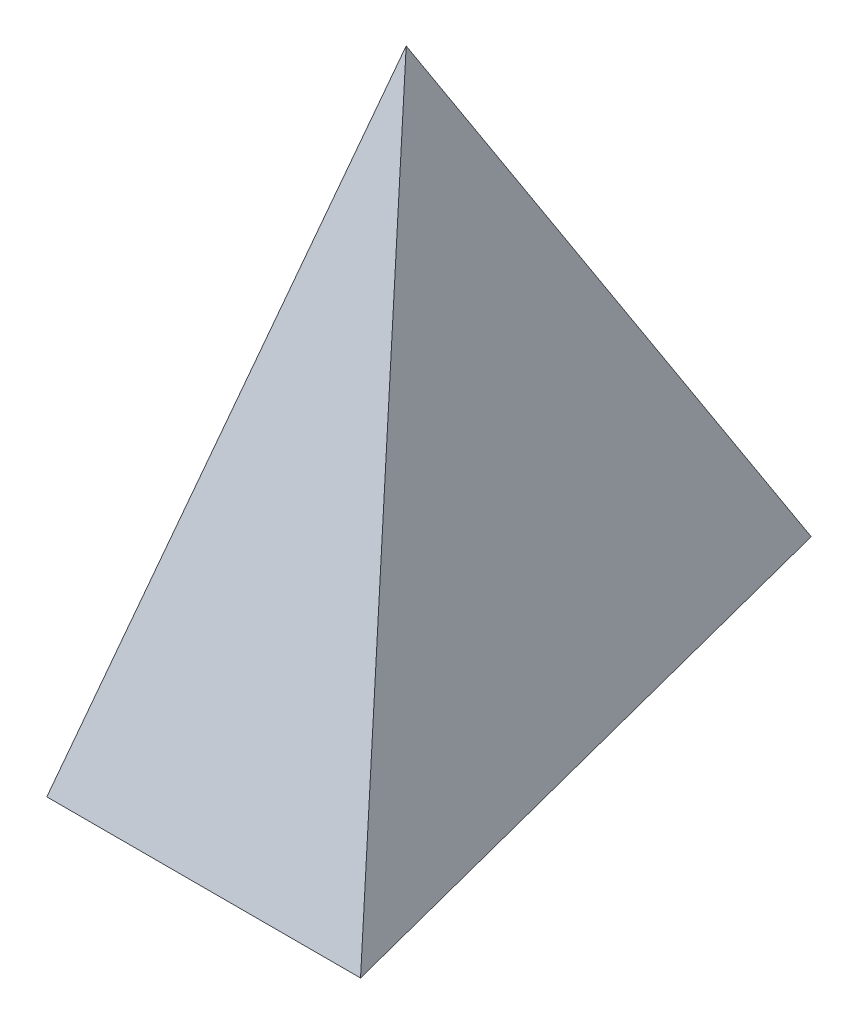
ISO-10303-21;
HEADER;
FILE_DESCRIPTION(('STEP AP214'),'2;1');
FILE_NAME('part.step','',(''),(''),'','','');
FILE_SCHEMA(('AUTOMOTIVE_DESIGN { 1 0 10303 214 1 1 1 1 }'));
ENDSEC;
DATA;
#1=APPLICATION_CONTEXT('core data for automotive mechanical design processes');
#2=APPLICATION_PROTOCOL_DEFINITION('international standard','automotive_design',2000,#1);
#3=PRODUCT_CONTEXT('',#1,'mechanical');
#4=PRODUCT('Part','Part','',(#3));
#5=PRODUCT_RELATED_PRODUCT_CATEGORY('part','',(#4));
#6=PRODUCT_DEFINITION_FORMATION('','',#4);
#7=PRODUCT_DEFINITION_CONTEXT('part definition',#1,'design');
#8=PRODUCT_DEFINITION('design','',#6,#7);
#9=PRODUCT_DEFINITION_SHAPE('','',#8);
#10=(LENGTH_UNIT() NAMED_UNIT(*) SI_UNIT(.MILLI.,.METRE.));
#11=(NAMED_UNIT(*) PLANE_ANGLE_UNIT() SI_UNIT($,.RADIAN.));
#12=(NAMED_UNIT(*) SI_UNIT($,.STERADIAN.) SOLID_ANGLE_UNIT());
#13=UNCERTAINTY_MEASURE_WITH_UNIT(LENGTH_MEASURE(1.E-05),#10,'distance_accuracy_value','');
#14=(GEOMETRIC_REPRESENTATION_CONTEXT(3) GLOBAL_UNCERTAINTY_ASSIGNED_CONTEXT((#13)) GLOBAL_UNIT_ASSIGNED_CONTEXT((#10,
#11,#12)) REPRESENTATION_CONTEXT('',''));
#15=CARTESIAN_POINT('',(0.,0.,0.));
#16=DIRECTION('',(0.,0.,1.));
#17=DIRECTION('',(1.,0.,0.));
#18=AXIS2_PLACEMENT_3D('',#15,#16,#17);
#19=CARTESIAN_POINT('',(0.,0.,0.));
#20=DIRECTION('',(0.,1.,0.));
#21=DIRECTION('',(0.,0.,1.));
#22=AXIS2_PLACEMENT_3D('',#19,#20,#21);
#23=PLANE('',#22);
#24=DIRECTION('',(-0.25,0.,0.968245836551854));
#25=VECTOR('',#24,1.);
#26=CARTESIAN_POINT('',(4.99999999999999,0.,-19.3649167310371));
#27=LINE('',#26,#25);
#28=CARTESIAN_POINT('',(4.99999999999999,0.,-19.3649167310371));
#29=VERTEX_POINT('',#28);
#30=CARTESIAN_POINT('',(0.,0.,0.));
#31=VERTEX_POINT('',#30);
#32=EDGE_CURVE('E66',#29,#31,#27,.T.);
#33=ORIENTED_EDGE('',*,*,#32,.F.);
#34=DIRECTION('',(-0.25,0.,-0.968245836551854));
#35=VECTOR('',#34,1.);
#36=CARTESIAN_POINT('',(10.,0.,0.));
#37=LINE('',#36,#35);
#38=CARTESIAN_POINT('',(10.,0.,0.));
#39=VERTEX_POINT('',#38);
#40=EDGE_CURVE('E12',#39,#29,#37,.T.);
#41=ORIENTED_EDGE('',*,*,#40,.F.);
#42=DIRECTION('',(1.,0.,0.));
#43=VECTOR('',#42,1.);
#44=CARTESIAN_POINT('',(0.,0.,0.));
#45=LINE('',#44,#43);
#46=EDGE_CURVE('E43',#31,#39,#45,.T.);
#47=ORIENTED_EDGE('',*,*,#46,.F.);
#48=EDGE_LOOP('',(#33,#41,#47));
#49=FACE_BOUND('',#48,.T.);
#50=ADVANCED_FACE('F33',(#49),#23,.F.);
#51=CARTESIAN_POINT('',(0.,0.,0.));
#52=DIRECTION('',(0.,0.307147558416976,0.951661902861773));
#53=DIRECTION('',(0.,-0.951661902861773,0.307147558416976));
#54=AXIS2_PLACEMENT_3D('',#51,#52,#53);
#55=PLANE('',#54);
#56=DIRECTION('',(-0.231455024943138,-0.925820099772551,0.298807152333599));
#57=VECTOR('',#56,1.);
#58=CARTESIAN_POINT('',(5.,20.,-6.45497224367904));
#59=LINE('',#58,#57);
#60=CARTESIAN_POINT('',(5.,20.,-6.45497224367904));
#61=VERTEX_POINT('',#60);
#62=EDGE_CURVE('E63',#61,#31,#59,.T.);
#63=ORIENTED_EDGE('',*,*,#62,.T.);
#64=ORIENTED_EDGE('',*,*,#46,.T.);
#65=DIRECTION('',(0.231455024943138,-0.925820099772551,0.298807152333599));
#66=VECTOR('',#65,1.);
#67=CARTESIAN_POINT('',(5.,20.,-6.45497224367904));
#68=LINE('',#67,#66);
#69=EDGE_CURVE('E69',#61,#39,#68,.T.);
#70=ORIENTED_EDGE('',*,*,#69,.F.);
#71=EDGE_LOOP('',(#63,#64,#70));
#72=FACE_BOUND('',#71,.T.);
#73=ADVANCED_FACE('F72',(#72),#55,.T.);
#74=CARTESIAN_POINT('',(10.,0.,0.));
#75=DIRECTION('',(0.955879481815749,0.159313246969292,-0.246807020936918));
#76=DIRECTION('',(-0.25,0.,-0.968245836551854));
#77=AXIS2_PLACEMENT_3D('',#74,#75,#76);
#78=PLANE('',#77);
#79=ORIENTED_EDGE('',*,*,#69,.T.);
#80=ORIENTED_EDGE('',*,*,#40,.T.);
#81=DIRECTION('',(0.,-0.840168050416806,-0.54232614454664));
#82=VECTOR('',#81,1.);
#83=CARTESIAN_POINT('',(5.,20.,-6.45497224367904));
#84=LINE('',#83,#82);
#85=EDGE_CURVE('E51',#61,#29,#84,.T.);
#86=ORIENTED_EDGE('',*,*,#85,.F.);
#87=EDGE_LOOP('',(#79,#80,#86));
#88=FACE_BOUND('',#87,.T.);
#89=ADVANCED_FACE('F76',(#88),#78,.T.);
#90=CARTESIAN_POINT('',(5.,0.,-19.3649167310371));
#91=DIRECTION('',(-0.955879481815749,0.159313246969291,-0.246807020936918));
#92=DIRECTION('',(-0.25,0.,0.968245836551854));
#93=AXIS2_PLACEMENT_3D('',#90,#91,#92);
#94=PLANE('',#93);
#95=ORIENTED_EDGE('',*,*,#85,.T.);
#96=ORIENTED_EDGE('',*,*,#32,.T.);
#97=ORIENTED_EDGE('',*,*,#62,.F.);
#98=EDGE_LOOP('',(#95,#96,#97));
#99=FACE_BOUND('',#98,.T.);
#100=ADVANCED_FACE('F65',(#99),#94,.T.);
#101=CLOSED_SHELL('',(#50,#73,#89,#100));
#102=MANIFOLD_SOLID_BREP('B2',#101);
#103=ADVANCED_BREP_SHAPE_REPRESENTATION('',(#18,#102),#14);
#104=SHAPE_DEFINITION_REPRESENTATION(#9,#103);
ENDSEC;
END-ISO-10303-21;
